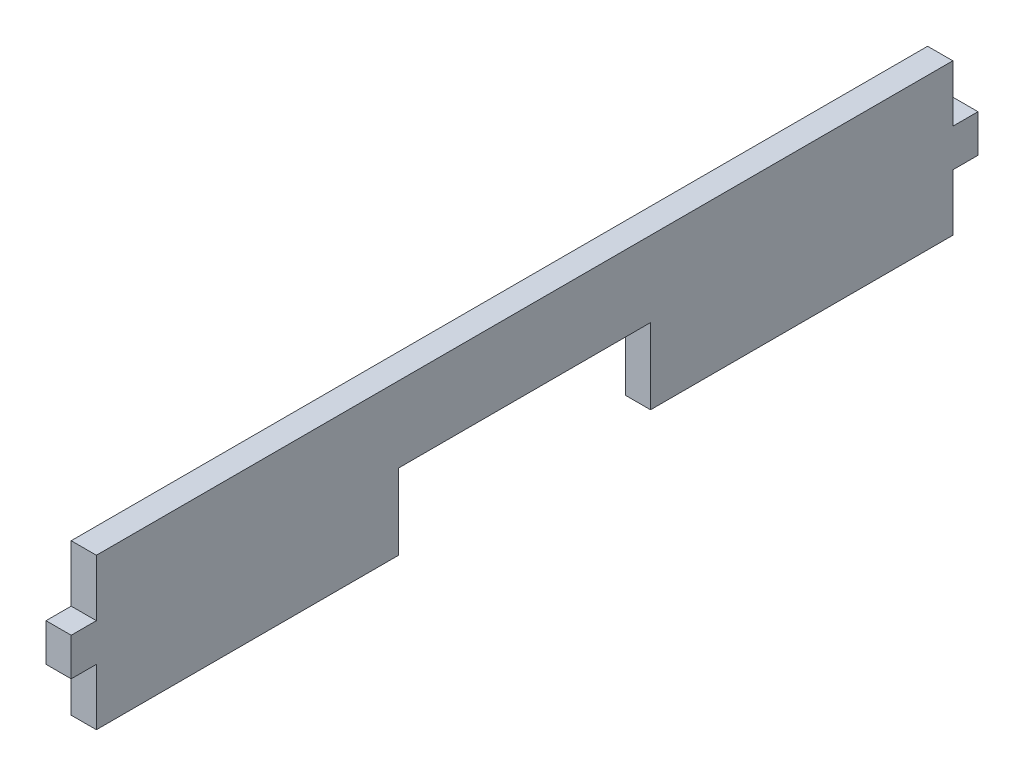
ISO-10303-21;
HEADER;
FILE_DESCRIPTION(('STEP AP214'),'2;1');
FILE_NAME('part.step','',(''),(''),'','','');
FILE_SCHEMA(('AUTOMOTIVE_DESIGN { 1 0 10303 214 1 1 1 1 }'));
ENDSEC;
DATA;
#1=APPLICATION_CONTEXT('core data for automotive mechanical design processes');
#2=APPLICATION_PROTOCOL_DEFINITION('international standard','automotive_design',2000,#1);
#3=PRODUCT_CONTEXT('',#1,'mechanical');
#4=PRODUCT('Part','Part','',(#3));
#5=PRODUCT_RELATED_PRODUCT_CATEGORY('part','',(#4));
#6=PRODUCT_DEFINITION_FORMATION('','',#4);
#7=PRODUCT_DEFINITION_CONTEXT('part definition',#1,'design');
#8=PRODUCT_DEFINITION('design','',#6,#7);
#9=PRODUCT_DEFINITION_SHAPE('','',#8);
#10=(LENGTH_UNIT() NAMED_UNIT(*) SI_UNIT(.MILLI.,.METRE.));
#11=(NAMED_UNIT(*) PLANE_ANGLE_UNIT() SI_UNIT($,.RADIAN.));
#12=(NAMED_UNIT(*) SI_UNIT($,.STERADIAN.) SOLID_ANGLE_UNIT());
#13=UNCERTAINTY_MEASURE_WITH_UNIT(LENGTH_MEASURE(1.E-05),#10,'distance_accuracy_value','');
#14=(GEOMETRIC_REPRESENTATION_CONTEXT(3) GLOBAL_UNCERTAINTY_ASSIGNED_CONTEXT((#13)) GLOBAL_UNIT_ASSIGNED_CONTEXT((#10,
#11,#12)) REPRESENTATION_CONTEXT('',''));
#15=CARTESIAN_POINT('',(0.,0.,0.));
#16=DIRECTION('',(0.,0.,1.));
#17=DIRECTION('',(1.,0.,0.));
#18=AXIS2_PLACEMENT_3D('',#15,#16,#17);
#19=CARTESIAN_POINT('',(2.54,-7.62,43.18));
#20=DIRECTION('',(0.,1.,0.));
#21=DIRECTION('',(0.,0.,1.));
#22=AXIS2_PLACEMENT_3D('',#19,#20,#21);
#23=PLANE('',#22);
#24=DIRECTION('',(0.,0.,-1.));
#25=VECTOR('',#24,1.);
#26=CARTESIAN_POINT('',(2.54,-7.62,43.18));
#27=LINE('',#26,#25);
#28=CARTESIAN_POINT('',(2.54,-7.62,-12.7));
#29=VERTEX_POINT('',#28);
#30=CARTESIAN_POINT('',(2.54,-7.62,-43.18));
#31=VERTEX_POINT('',#30);
#32=EDGE_CURVE('E57',#29,#31,#27,.T.);
#33=ORIENTED_EDGE('',*,*,#32,.F.);
#34=DIRECTION('',(1.,0.,0.));
#35=VECTOR('',#34,1.);
#36=CARTESIAN_POINT('',(-0.00100000000000013,-7.62,-12.7));
#37=LINE('',#36,#35);
#38=CARTESIAN_POINT('',(0.,-7.62,-12.7));
#39=VERTEX_POINT('',#38);
#40=EDGE_CURVE('E286',#39,#29,#37,.T.);
#41=ORIENTED_EDGE('',*,*,#40,.F.);
#42=DIRECTION('',(0.,0.,-1.));
#43=VECTOR('',#42,1.);
#44=CARTESIAN_POINT('',(0.,-7.62,43.18));
#45=LINE('',#44,#43);
#46=CARTESIAN_POINT('',(0.,-7.62,-43.18));
#47=VERTEX_POINT('',#46);
#48=EDGE_CURVE('E103',#39,#47,#45,.T.);
#49=ORIENTED_EDGE('',*,*,#48,.T.);
#50=DIRECTION('',(-1.,0.,0.));
#51=VECTOR('',#50,1.);
#52=CARTESIAN_POINT('',(2.54,-7.62,-43.18));
#53=LINE('',#52,#51);
#54=EDGE_CURVE('E169',#31,#47,#53,.T.);
#55=ORIENTED_EDGE('',*,*,#54,.F.);
#56=EDGE_LOOP('',(#33,#41,#49,#55));
#57=FACE_BOUND('',#56,.T.);
#58=ADVANCED_FACE('F33',(#57),#23,.F.);
#59=CARTESIAN_POINT('',(2.54,-1.90500000000001,-43.18));
#60=DIRECTION('',(0.,0.,1.));
#61=DIRECTION('',(1.,0.,0.));
#62=AXIS2_PLACEMENT_3D('',#59,#60,#61);
#63=PLANE('',#62);
#64=DIRECTION('',(0.,1.,0.));
#65=VECTOR('',#64,1.);
#66=CARTESIAN_POINT('',(0.,-1.90500000000001,-43.18));
#67=LINE('',#66,#65);
#68=CARTESIAN_POINT('',(0.,-1.90500000000001,-43.18));
#69=VERTEX_POINT('',#68);
#70=EDGE_CURVE('E170',#47,#69,#67,.T.);
#71=ORIENTED_EDGE('',*,*,#70,.T.);
#72=DIRECTION('',(-1.,0.,0.));
#73=VECTOR('',#72,1.);
#74=CARTESIAN_POINT('',(2.54,-1.90500000000001,-43.18));
#75=LINE('',#74,#73);
#76=CARTESIAN_POINT('',(2.54,-1.90500000000001,-43.18));
#77=VERTEX_POINT('',#76);
#78=EDGE_CURVE('E11',#77,#69,#75,.T.);
#79=ORIENTED_EDGE('',*,*,#78,.F.);
#80=DIRECTION('',(0.,1.,0.));
#81=VECTOR('',#80,1.);
#82=CARTESIAN_POINT('',(2.54,-1.90500000000001,-43.18));
#83=LINE('',#82,#81);
#84=EDGE_CURVE('E196',#31,#77,#83,.T.);
#85=ORIENTED_EDGE('',*,*,#84,.F.);
#86=ORIENTED_EDGE('',*,*,#54,.T.);
#87=EDGE_LOOP('',(#71,#79,#85,#86));
#88=FACE_BOUND('',#87,.T.);
#89=ADVANCED_FACE('F35',(#88),#63,.F.);
#90=CARTESIAN_POINT('',(2.54,-1.90500000000001,-45.72));
#91=DIRECTION('',(0.,1.,0.));
#92=DIRECTION('',(0.,0.,1.));
#93=AXIS2_PLACEMENT_3D('',#90,#91,#92);
#94=PLANE('',#93);
#95=DIRECTION('',(0.,0.,-1.));
#96=VECTOR('',#95,1.);
#97=CARTESIAN_POINT('',(0.,-1.90500000000001,-45.72));
#98=LINE('',#97,#96);
#99=CARTESIAN_POINT('',(0.,-1.90500000000001,-45.72));
#100=VERTEX_POINT('',#99);
#101=EDGE_CURVE('E173',#69,#100,#98,.T.);
#102=ORIENTED_EDGE('',*,*,#101,.T.);
#103=DIRECTION('',(-1.,0.,0.));
#104=VECTOR('',#103,1.);
#105=CARTESIAN_POINT('',(2.54,-1.90500000000001,-45.72));
#106=LINE('',#105,#104);
#107=CARTESIAN_POINT('',(2.54,-1.90500000000001,-45.72));
#108=VERTEX_POINT('',#107);
#109=EDGE_CURVE('E41',#108,#100,#106,.T.);
#110=ORIENTED_EDGE('',*,*,#109,.F.);
#111=DIRECTION('',(0.,0.,-1.));
#112=VECTOR('',#111,1.);
#113=CARTESIAN_POINT('',(2.54,-1.90500000000001,-45.72));
#114=LINE('',#113,#112);
#115=EDGE_CURVE('E111',#77,#108,#114,.T.);
#116=ORIENTED_EDGE('',*,*,#115,.F.);
#117=ORIENTED_EDGE('',*,*,#78,.T.);
#118=EDGE_LOOP('',(#102,#110,#116,#117));
#119=FACE_BOUND('',#118,.T.);
#120=ADVANCED_FACE('F328',(#119),#94,.F.);
#121=CARTESIAN_POINT('',(2.54,1.90500000000001,-45.72));
#122=DIRECTION('',(0.,0.,1.));
#123=DIRECTION('',(1.,0.,0.));
#124=AXIS2_PLACEMENT_3D('',#121,#122,#123);
#125=PLANE('',#124);
#126=DIRECTION('',(0.,1.,0.));
#127=VECTOR('',#126,1.);
#128=CARTESIAN_POINT('',(0.,1.90500000000001,-45.72));
#129=LINE('',#128,#127);
#130=CARTESIAN_POINT('',(0.,1.90500000000001,-45.72));
#131=VERTEX_POINT('',#130);
#132=EDGE_CURVE('E176',#100,#131,#129,.T.);
#133=ORIENTED_EDGE('',*,*,#132,.T.);
#134=DIRECTION('',(-1.,0.,0.));
#135=VECTOR('',#134,1.);
#136=CARTESIAN_POINT('',(2.54,1.90500000000001,-45.72));
#137=LINE('',#136,#135);
#138=CARTESIAN_POINT('',(2.54,1.90500000000001,-45.72));
#139=VERTEX_POINT('',#138);
#140=EDGE_CURVE('E215',#139,#131,#137,.T.);
#141=ORIENTED_EDGE('',*,*,#140,.F.);
#142=DIRECTION('',(0.,1.,0.));
#143=VECTOR('',#142,1.);
#144=CARTESIAN_POINT('',(2.54,1.90500000000001,-45.72));
#145=LINE('',#144,#143);
#146=EDGE_CURVE('E223',#108,#139,#145,.T.);
#147=ORIENTED_EDGE('',*,*,#146,.F.);
#148=ORIENTED_EDGE('',*,*,#109,.T.);
#149=EDGE_LOOP('',(#133,#141,#147,#148));
#150=FACE_BOUND('',#149,.T.);
#151=ADVANCED_FACE('F221',(#150),#125,.F.);
#152=CARTESIAN_POINT('',(2.54,1.90500000000001,-43.18));
#153=DIRECTION('',(0.,-1.,0.));
#154=DIRECTION('',(0.,0.,-1.));
#155=AXIS2_PLACEMENT_3D('',#152,#153,#154);
#156=PLANE('',#155);
#157=DIRECTION('',(0.,0.,1.));
#158=VECTOR('',#157,1.);
#159=CARTESIAN_POINT('',(0.,1.90500000000001,-43.18));
#160=LINE('',#159,#158);
#161=CARTESIAN_POINT('',(0.,1.90500000000001,-43.18));
#162=VERTEX_POINT('',#161);
#163=EDGE_CURVE('E178',#131,#162,#160,.T.);
#164=ORIENTED_EDGE('',*,*,#163,.T.);
#165=DIRECTION('',(-1.,0.,0.));
#166=VECTOR('',#165,1.);
#167=CARTESIAN_POINT('',(2.54,1.90500000000001,-43.18));
#168=LINE('',#167,#166);
#169=CARTESIAN_POINT('',(2.54,1.90500000000001,-43.18));
#170=VERTEX_POINT('',#169);
#171=EDGE_CURVE('E212',#170,#162,#168,.T.);
#172=ORIENTED_EDGE('',*,*,#171,.F.);
#173=DIRECTION('',(0.,0.,1.));
#174=VECTOR('',#173,1.);
#175=CARTESIAN_POINT('',(2.54,1.90500000000001,-43.18));
#176=LINE('',#175,#174);
#177=EDGE_CURVE('E241',#139,#170,#176,.T.);
#178=ORIENTED_EDGE('',*,*,#177,.F.);
#179=ORIENTED_EDGE('',*,*,#140,.T.);
#180=EDGE_LOOP('',(#164,#172,#178,#179));
#181=FACE_BOUND('',#180,.T.);
#182=ADVANCED_FACE('F232',(#181),#156,.F.);
#183=CARTESIAN_POINT('',(2.54,7.62,-43.18));
#184=DIRECTION('',(0.,0.,1.));
#185=DIRECTION('',(1.,0.,0.));
#186=AXIS2_PLACEMENT_3D('',#183,#184,#185);
#187=PLANE('',#186);
#188=DIRECTION('',(0.,1.,0.));
#189=VECTOR('',#188,1.);
#190=CARTESIAN_POINT('',(0.,7.62,-43.18));
#191=LINE('',#190,#189);
#192=CARTESIAN_POINT('',(0.,7.62,-43.18));
#193=VERTEX_POINT('',#192);
#194=EDGE_CURVE('E180',#162,#193,#191,.T.);
#195=ORIENTED_EDGE('',*,*,#194,.T.);
#196=DIRECTION('',(-1.,0.,0.));
#197=VECTOR('',#196,1.);
#198=CARTESIAN_POINT('',(2.54,7.62,-43.18));
#199=LINE('',#198,#197);
#200=CARTESIAN_POINT('',(2.54,7.62,-43.18));
#201=VERTEX_POINT('',#200);
#202=EDGE_CURVE('E209',#201,#193,#199,.T.);
#203=ORIENTED_EDGE('',*,*,#202,.F.);
#204=DIRECTION('',(0.,1.,0.));
#205=VECTOR('',#204,1.);
#206=CARTESIAN_POINT('',(2.54,7.62,-43.18));
#207=LINE('',#206,#205);
#208=EDGE_CURVE('E238',#170,#201,#207,.T.);
#209=ORIENTED_EDGE('',*,*,#208,.F.);
#210=ORIENTED_EDGE('',*,*,#171,.T.);
#211=EDGE_LOOP('',(#195,#203,#209,#210));
#212=FACE_BOUND('',#211,.T.);
#213=ADVANCED_FACE('F236',(#212),#187,.F.);
#214=CARTESIAN_POINT('',(2.54,7.62,43.18));
#215=DIRECTION('',(0.,-1.,0.));
#216=DIRECTION('',(0.,0.,-1.));
#217=AXIS2_PLACEMENT_3D('',#214,#215,#216);
#218=PLANE('',#217);
#219=DIRECTION('',(0.,0.,1.));
#220=VECTOR('',#219,1.);
#221=CARTESIAN_POINT('',(0.,7.62,43.18));
#222=LINE('',#221,#220);
#223=CARTESIAN_POINT('',(0.,7.62,43.18));
#224=VERTEX_POINT('',#223);
#225=EDGE_CURVE('E182',#193,#224,#222,.T.);
#226=ORIENTED_EDGE('',*,*,#225,.T.);
#227=DIRECTION('',(-1.,0.,0.));
#228=VECTOR('',#227,1.);
#229=CARTESIAN_POINT('',(2.54,7.62,43.18));
#230=LINE('',#229,#228);
#231=CARTESIAN_POINT('',(2.54,7.62,43.18));
#232=VERTEX_POINT('',#231);
#233=EDGE_CURVE('E206',#232,#224,#230,.T.);
#234=ORIENTED_EDGE('',*,*,#233,.F.);
#235=DIRECTION('',(0.,0.,1.));
#236=VECTOR('',#235,1.);
#237=CARTESIAN_POINT('',(2.54,7.62,43.18));
#238=LINE('',#237,#236);
#239=EDGE_CURVE('E240',#201,#232,#238,.T.);
#240=ORIENTED_EDGE('',*,*,#239,.F.);
#241=ORIENTED_EDGE('',*,*,#202,.T.);
#242=EDGE_LOOP('',(#226,#234,#240,#241));
#243=FACE_BOUND('',#242,.T.);
#244=ADVANCED_FACE('F349',(#243),#218,.F.);
#245=CARTESIAN_POINT('',(2.54,7.62,43.18));
#246=DIRECTION('',(0.,0.,-1.));
#247=DIRECTION('',(-1.,0.,0.));
#248=AXIS2_PLACEMENT_3D('',#245,#246,#247);
#249=PLANE('',#248);
#250=DIRECTION('',(0.,-1.,0.));
#251=VECTOR('',#250,1.);
#252=CARTESIAN_POINT('',(0.,7.62,43.18));
#253=LINE('',#252,#251);
#254=CARTESIAN_POINT('',(0.,1.905,43.18));
#255=VERTEX_POINT('',#254);
#256=EDGE_CURVE('E184',#224,#255,#253,.T.);
#257=ORIENTED_EDGE('',*,*,#256,.T.);
#258=DIRECTION('',(-1.,0.,0.));
#259=VECTOR('',#258,1.);
#260=CARTESIAN_POINT('',(2.54,1.905,43.18));
#261=LINE('',#260,#259);
#262=CARTESIAN_POINT('',(2.54,1.905,43.18));
#263=VERTEX_POINT('',#262);
#264=EDGE_CURVE('E203',#263,#255,#261,.T.);
#265=ORIENTED_EDGE('',*,*,#264,.F.);
#266=DIRECTION('',(0.,-1.,0.));
#267=VECTOR('',#266,1.);
#268=CARTESIAN_POINT('',(2.54,7.62,43.18));
#269=LINE('',#268,#267);
#270=EDGE_CURVE('E243',#232,#263,#269,.T.);
#271=ORIENTED_EDGE('',*,*,#270,.F.);
#272=ORIENTED_EDGE('',*,*,#233,.T.);
#273=EDGE_LOOP('',(#257,#265,#271,#272));
#274=FACE_BOUND('',#273,.T.);
#275=ADVANCED_FACE('F346',(#274),#249,.F.);
#276=CARTESIAN_POINT('',(2.54,1.905,43.18));
#277=DIRECTION('',(0.,-1.,0.));
#278=DIRECTION('',(0.,0.,-1.));
#279=AXIS2_PLACEMENT_3D('',#276,#277,#278);
#280=PLANE('',#279);
#281=DIRECTION('',(0.,0.,1.));
#282=VECTOR('',#281,1.);
#283=CARTESIAN_POINT('',(0.,1.905,43.18));
#284=LINE('',#283,#282);
#285=CARTESIAN_POINT('',(0.,1.905,45.72));
#286=VERTEX_POINT('',#285);
#287=EDGE_CURVE('E186',#255,#286,#284,.T.);
#288=ORIENTED_EDGE('',*,*,#287,.T.);
#289=DIRECTION('',(-1.,0.,0.));
#290=VECTOR('',#289,1.);
#291=CARTESIAN_POINT('',(2.54,1.905,45.72));
#292=LINE('',#291,#290);
#293=CARTESIAN_POINT('',(2.54,1.905,45.72));
#294=VERTEX_POINT('',#293);
#295=EDGE_CURVE('E200',#294,#286,#292,.T.);
#296=ORIENTED_EDGE('',*,*,#295,.F.);
#297=DIRECTION('',(0.,0.,1.));
#298=VECTOR('',#297,1.);
#299=CARTESIAN_POINT('',(2.54,1.905,43.18));
#300=LINE('',#299,#298);
#301=EDGE_CURVE('E249',#263,#294,#300,.T.);
#302=ORIENTED_EDGE('',*,*,#301,.F.);
#303=ORIENTED_EDGE('',*,*,#264,.T.);
#304=EDGE_LOOP('',(#288,#296,#302,#303));
#305=FACE_BOUND('',#304,.T.);
#306=ADVANCED_FACE('F255',(#305),#280,.F.);
#307=CARTESIAN_POINT('',(2.54,1.905,45.72));
#308=DIRECTION('',(0.,0.,-1.));
#309=DIRECTION('',(-1.,0.,0.));
#310=AXIS2_PLACEMENT_3D('',#307,#308,#309);
#311=PLANE('',#310);
#312=DIRECTION('',(0.,-1.,0.));
#313=VECTOR('',#312,1.);
#314=CARTESIAN_POINT('',(0.,1.905,45.72));
#315=LINE('',#314,#313);
#316=CARTESIAN_POINT('',(0.,-1.905,45.72));
#317=VERTEX_POINT('',#316);
#318=EDGE_CURVE('E188',#286,#317,#315,.T.);
#319=ORIENTED_EDGE('',*,*,#318,.T.);
#320=DIRECTION('',(-1.,0.,0.));
#321=VECTOR('',#320,1.);
#322=CARTESIAN_POINT('',(2.54,-1.905,45.72));
#323=LINE('',#322,#321);
#324=CARTESIAN_POINT('',(2.54,-1.905,45.72));
#325=VERTEX_POINT('',#324);
#326=EDGE_CURVE('E158',#325,#317,#323,.T.);
#327=ORIENTED_EDGE('',*,*,#326,.F.);
#328=DIRECTION('',(0.,-1.,0.));
#329=VECTOR('',#328,1.);
#330=CARTESIAN_POINT('',(2.54,1.905,45.72));
#331=LINE('',#330,#329);
#332=EDGE_CURVE('E146',#294,#325,#331,.T.);
#333=ORIENTED_EDGE('',*,*,#332,.F.);
#334=ORIENTED_EDGE('',*,*,#295,.T.);
#335=EDGE_LOOP('',(#319,#327,#333,#334));
#336=FACE_BOUND('',#335,.T.);
#337=ADVANCED_FACE('F259',(#336),#311,.F.);
#338=CARTESIAN_POINT('',(2.54,-1.905,45.72));
#339=DIRECTION('',(0.,1.,0.));
#340=DIRECTION('',(0.,0.,1.));
#341=AXIS2_PLACEMENT_3D('',#338,#339,#340);
#342=PLANE('',#341);
#343=DIRECTION('',(0.,0.,-1.));
#344=VECTOR('',#343,1.);
#345=CARTESIAN_POINT('',(0.,-1.905,45.72));
#346=LINE('',#345,#344);
#347=CARTESIAN_POINT('',(0.,-1.905,43.18));
#348=VERTEX_POINT('',#347);
#349=EDGE_CURVE('E155',#317,#348,#346,.T.);
#350=ORIENTED_EDGE('',*,*,#349,.T.);
#351=DIRECTION('',(-1.,0.,0.));
#352=VECTOR('',#351,1.);
#353=CARTESIAN_POINT('',(2.54,-1.905,43.18));
#354=LINE('',#353,#352);
#355=CARTESIAN_POINT('',(2.54,-1.905,43.18));
#356=VERTEX_POINT('',#355);
#357=EDGE_CURVE('E152',#356,#348,#354,.T.);
#358=ORIENTED_EDGE('',*,*,#357,.F.);
#359=DIRECTION('',(0.,0.,-1.));
#360=VECTOR('',#359,1.);
#361=CARTESIAN_POINT('',(2.54,-1.905,45.72));
#362=LINE('',#361,#360);
#363=EDGE_CURVE('E138',#325,#356,#362,.T.);
#364=ORIENTED_EDGE('',*,*,#363,.F.);
#365=ORIENTED_EDGE('',*,*,#326,.T.);
#366=EDGE_LOOP('',(#350,#358,#364,#365));
#367=FACE_BOUND('',#366,.T.);
#368=ADVANCED_FACE('F153',(#367),#342,.F.);
#369=CARTESIAN_POINT('',(2.54,-1.905,43.18));
#370=DIRECTION('',(0.,0.,-1.));
#371=DIRECTION('',(-1.,0.,0.));
#372=AXIS2_PLACEMENT_3D('',#369,#370,#371);
#373=PLANE('',#372);
#374=DIRECTION('',(0.,-1.,0.));
#375=VECTOR('',#374,1.);
#376=CARTESIAN_POINT('',(0.,-1.905,43.18));
#377=LINE('',#376,#375);
#378=CARTESIAN_POINT('',(0.,-7.62,43.18));
#379=VERTEX_POINT('',#378);
#380=EDGE_CURVE('E191',#348,#379,#377,.T.);
#381=ORIENTED_EDGE('',*,*,#380,.T.);
#382=DIRECTION('',(-1.,0.,0.));
#383=VECTOR('',#382,1.);
#384=CARTESIAN_POINT('',(2.54,-7.62,43.18));
#385=LINE('',#384,#383);
#386=CARTESIAN_POINT('',(2.54,-7.62,43.18));
#387=VERTEX_POINT('',#386);
#388=EDGE_CURVE('E159',#387,#379,#385,.T.);
#389=ORIENTED_EDGE('',*,*,#388,.F.);
#390=DIRECTION('',(0.,-1.,0.));
#391=VECTOR('',#390,1.);
#392=CARTESIAN_POINT('',(2.54,-1.905,43.18));
#393=LINE('',#392,#391);
#394=EDGE_CURVE('E143',#356,#387,#393,.T.);
#395=ORIENTED_EDGE('',*,*,#394,.F.);
#396=ORIENTED_EDGE('',*,*,#357,.T.);
#397=EDGE_LOOP('',(#381,#389,#395,#396));
#398=FACE_BOUND('',#397,.T.);
#399=ADVANCED_FACE('F161',(#398),#373,.F.);
#400=CARTESIAN_POINT('',(0.,-7.62,12.7));
#401=VERTEX_POINT('',#400);
#402=EDGE_CURVE('E193',#379,#401,#45,.T.);
#403=ORIENTED_EDGE('',*,*,#402,.T.);
#404=DIRECTION('',(1.,0.,0.));
#405=VECTOR('',#404,1.);
#406=CARTESIAN_POINT('',(-0.00100000000000013,-7.62,12.7));
#407=LINE('',#406,#405);
#408=CARTESIAN_POINT('',(2.54,-7.62,12.7));
#409=VERTEX_POINT('',#408);
#410=EDGE_CURVE('E266',#401,#409,#407,.T.);
#411=ORIENTED_EDGE('',*,*,#410,.T.);
#412=EDGE_CURVE('E165',#387,#409,#27,.T.);
#413=ORIENTED_EDGE('',*,*,#412,.F.);
#414=ORIENTED_EDGE('',*,*,#388,.T.);
#415=EDGE_LOOP('',(#403,#411,#413,#414));
#416=FACE_BOUND('',#415,.T.);
#417=ADVANCED_FACE('F262',(#416),#23,.F.);
#418=CARTESIAN_POINT('',(2.54,0.,0.));
#419=DIRECTION('',(1.,0.,0.));
#420=DIRECTION('',(0.,0.,-1.));
#421=AXIS2_PLACEMENT_3D('',#418,#419,#420);
#422=PLANE('',#421);
#423=DIRECTION('',(0.,1.,0.));
#424=VECTOR('',#423,1.);
#425=CARTESIAN_POINT('',(2.54,0.,-12.7));
#426=LINE('',#425,#424);
#427=CARTESIAN_POINT('',(2.54,0.,-12.7));
#428=VERTEX_POINT('',#427);
#429=EDGE_CURVE('E292',#29,#428,#426,.T.);
#430=ORIENTED_EDGE('',*,*,#429,.F.);
#431=ORIENTED_EDGE('',*,*,#32,.T.);
#432=ORIENTED_EDGE('',*,*,#84,.T.);
#433=ORIENTED_EDGE('',*,*,#115,.T.);
#434=ORIENTED_EDGE('',*,*,#146,.T.);
#435=ORIENTED_EDGE('',*,*,#177,.T.);
#436=ORIENTED_EDGE('',*,*,#208,.T.);
#437=ORIENTED_EDGE('',*,*,#239,.T.);
#438=ORIENTED_EDGE('',*,*,#270,.T.);
#439=ORIENTED_EDGE('',*,*,#301,.T.);
#440=ORIENTED_EDGE('',*,*,#332,.T.);
#441=ORIENTED_EDGE('',*,*,#363,.T.);
#442=ORIENTED_EDGE('',*,*,#394,.T.);
#443=ORIENTED_EDGE('',*,*,#412,.T.);
#444=DIRECTION('',(0.,-1.,0.));
#445=VECTOR('',#444,1.);
#446=CARTESIAN_POINT('',(2.54,0.,12.7));
#447=LINE('',#446,#445);
#448=CARTESIAN_POINT('',(2.54,0.,12.7));
#449=VERTEX_POINT('',#448);
#450=EDGE_CURVE('E271',#449,#409,#447,.T.);
#451=ORIENTED_EDGE('',*,*,#450,.F.);
#452=DIRECTION('',(0.,0.,1.));
#453=VECTOR('',#452,1.);
#454=CARTESIAN_POINT('',(2.54,0.,12.7));
#455=LINE('',#454,#453);
#456=EDGE_CURVE('E307',#428,#449,#455,.T.);
#457=ORIENTED_EDGE('',*,*,#456,.F.);
#458=EDGE_LOOP('',(#430,#431,#432,#433,#434,#435,#436,#437,#438,#439,#440,#441,#442,#443,#451,#457));
#459=FACE_BOUND('',#458,.T.);
#460=ADVANCED_FACE('F140',(#459),#422,.T.);
#461=CARTESIAN_POINT('',(0.,0.,0.));
#462=DIRECTION('',(1.,0.,0.));
#463=DIRECTION('',(0.,0.,-1.));
#464=AXIS2_PLACEMENT_3D('',#461,#462,#463);
#465=PLANE('',#464);
#466=ORIENTED_EDGE('',*,*,#48,.F.);
#467=DIRECTION('',(0.,-1.,0.));
#468=VECTOR('',#467,1.);
#469=CARTESIAN_POINT('',(0.,0.,-12.7));
#470=LINE('',#469,#468);
#471=CARTESIAN_POINT('',(0.,0.,-12.7));
#472=VERTEX_POINT('',#471);
#473=EDGE_CURVE('E283',#472,#39,#470,.T.);
#474=ORIENTED_EDGE('',*,*,#473,.F.);
#475=DIRECTION('',(0.,0.,-1.));
#476=VECTOR('',#475,1.);
#477=CARTESIAN_POINT('',(0.,0.,12.7));
#478=LINE('',#477,#476);
#479=CARTESIAN_POINT('',(0.,0.,12.7));
#480=VERTEX_POINT('',#479);
#481=EDGE_CURVE('E174',#480,#472,#478,.T.);
#482=ORIENTED_EDGE('',*,*,#481,.F.);
#483=DIRECTION('',(0.,1.,0.));
#484=VECTOR('',#483,1.);
#485=CARTESIAN_POINT('',(0.,0.,12.7));
#486=LINE('',#485,#484);
#487=EDGE_CURVE('E48',#401,#480,#486,.T.);
#488=ORIENTED_EDGE('',*,*,#487,.F.);
#489=ORIENTED_EDGE('',*,*,#402,.F.);
#490=ORIENTED_EDGE('',*,*,#380,.F.);
#491=ORIENTED_EDGE('',*,*,#349,.F.);
#492=ORIENTED_EDGE('',*,*,#318,.F.);
#493=ORIENTED_EDGE('',*,*,#287,.F.);
#494=ORIENTED_EDGE('',*,*,#256,.F.);
#495=ORIENTED_EDGE('',*,*,#225,.F.);
#496=ORIENTED_EDGE('',*,*,#194,.F.);
#497=ORIENTED_EDGE('',*,*,#163,.F.);
#498=ORIENTED_EDGE('',*,*,#132,.F.);
#499=ORIENTED_EDGE('',*,*,#101,.F.);
#500=ORIENTED_EDGE('',*,*,#70,.F.);
#501=EDGE_LOOP('',(#466,#474,#482,#488,#489,#490,#491,#492,#493,#494,#495,#496,#497,#498,#499,#500));
#502=FACE_BOUND('',#501,.T.);
#503=ADVANCED_FACE('F226',(#502),#465,.F.);
#504=CARTESIAN_POINT('',(-0.00100000000000013,0.,-12.7));
#505=DIRECTION('',(0.,0.,-1.));
#506=DIRECTION('',(-1.,0.,0.));
#507=AXIS2_PLACEMENT_3D('',#504,#505,#506);
#508=PLANE('',#507);
#509=ORIENTED_EDGE('',*,*,#473,.T.);
#510=ORIENTED_EDGE('',*,*,#40,.T.);
#511=ORIENTED_EDGE('',*,*,#429,.T.);
#512=DIRECTION('',(1.,0.,0.));
#513=VECTOR('',#512,1.);
#514=CARTESIAN_POINT('',(-0.00100000000000013,0.,-12.7));
#515=LINE('',#514,#513);
#516=EDGE_CURVE('E289',#472,#428,#515,.T.);
#517=ORIENTED_EDGE('',*,*,#516,.F.);
#518=EDGE_LOOP('',(#509,#510,#511,#517));
#519=FACE_BOUND('',#518,.T.);
#520=ADVANCED_FACE('F284',(#519),#508,.F.);
#521=CARTESIAN_POINT('',(-0.00100000000000013,0.,12.7));
#522=DIRECTION('',(0.,0.,1.));
#523=DIRECTION('',(1.,0.,0.));
#524=AXIS2_PLACEMENT_3D('',#521,#522,#523);
#525=PLANE('',#524);
#526=ORIENTED_EDGE('',*,*,#487,.T.);
#527=DIRECTION('',(1.,0.,0.));
#528=VECTOR('',#527,1.);
#529=CARTESIAN_POINT('',(-0.00100000000000013,0.,12.7));
#530=LINE('',#529,#528);
#531=EDGE_CURVE('E303',#480,#449,#530,.T.);
#532=ORIENTED_EDGE('',*,*,#531,.T.);
#533=ORIENTED_EDGE('',*,*,#450,.T.);
#534=ORIENTED_EDGE('',*,*,#410,.F.);
#535=EDGE_LOOP('',(#526,#532,#533,#534));
#536=FACE_BOUND('',#535,.T.);
#537=ADVANCED_FACE('F314',(#536),#525,.F.);
#538=CARTESIAN_POINT('',(-0.00100000000000013,0.,12.7));
#539=DIRECTION('',(0.,1.,0.));
#540=DIRECTION('',(0.,0.,1.));
#541=AXIS2_PLACEMENT_3D('',#538,#539,#540);
#542=PLANE('',#541);
#543=ORIENTED_EDGE('',*,*,#481,.T.);
#544=ORIENTED_EDGE('',*,*,#516,.T.);
#545=ORIENTED_EDGE('',*,*,#456,.T.);
#546=ORIENTED_EDGE('',*,*,#531,.F.);
#547=EDGE_LOOP('',(#543,#544,#545,#546));
#548=FACE_BOUND('',#547,.T.);
#549=ADVANCED_FACE('F312',(#548),#542,.F.);
#550=CLOSED_SHELL('',(#58,#89,#120,#151,#182,#213,#244,#275,#306,#337,#368,#399,#417,#460,#503,
#520,#537,#549));
#551=MANIFOLD_SOLID_BREP('B2',#550);
#552=ADVANCED_BREP_SHAPE_REPRESENTATION('',(#18,#551),#14);
#553=SHAPE_DEFINITION_REPRESENTATION(#9,#552);
ENDSEC;
END-ISO-10303-21;
